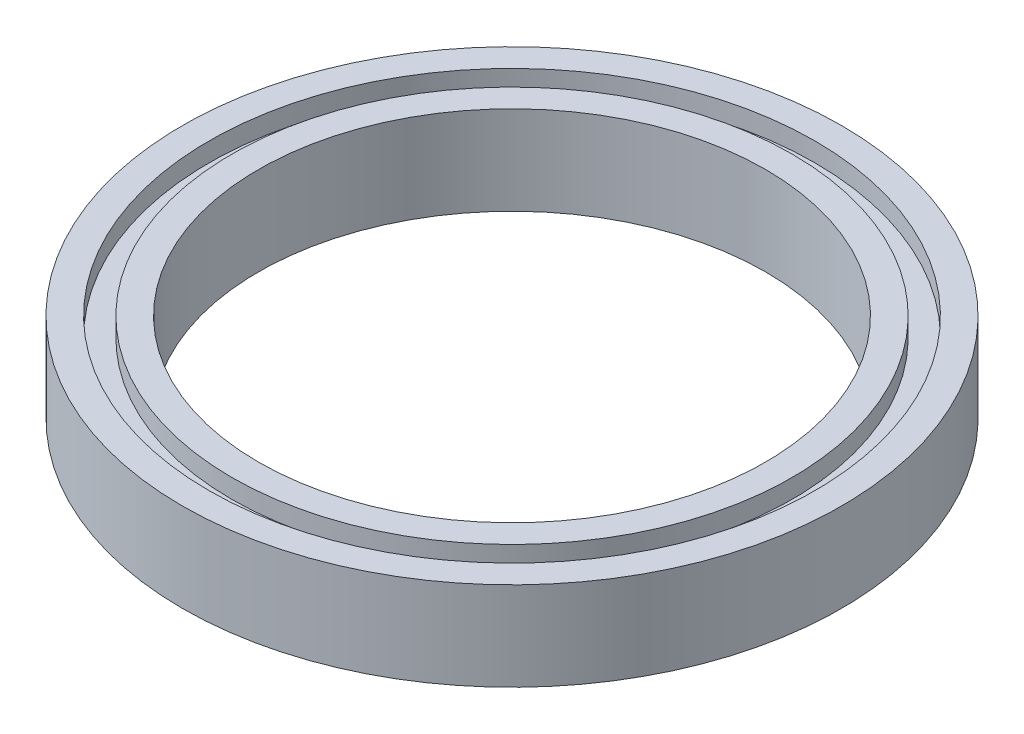
ISO-10303-21;
HEADER;
FILE_DESCRIPTION(('STEP AP214'),'2;1');
FILE_NAME('part.step','',(''),(''),'','','');
FILE_SCHEMA(('AUTOMOTIVE_DESIGN { 1 0 10303 214 1 1 1 1 }'));
ENDSEC;
DATA;
#1=APPLICATION_CONTEXT('core data for automotive mechanical design processes');
#2=APPLICATION_PROTOCOL_DEFINITION('international standard','automotive_design',2000,#1);
#3=PRODUCT_CONTEXT('',#1,'mechanical');
#4=PRODUCT('Part','Part','',(#3));
#5=PRODUCT_RELATED_PRODUCT_CATEGORY('part','',(#4));
#6=PRODUCT_DEFINITION_FORMATION('','',#4);
#7=PRODUCT_DEFINITION_CONTEXT('part definition',#1,'design');
#8=PRODUCT_DEFINITION('design','',#6,#7);
#9=PRODUCT_DEFINITION_SHAPE('','',#8);
#10=(LENGTH_UNIT() NAMED_UNIT(*) SI_UNIT(.MILLI.,.METRE.));
#11=(NAMED_UNIT(*) PLANE_ANGLE_UNIT() SI_UNIT($,.RADIAN.));
#12=(NAMED_UNIT(*) SI_UNIT($,.STERADIAN.) SOLID_ANGLE_UNIT());
#13=UNCERTAINTY_MEASURE_WITH_UNIT(LENGTH_MEASURE(1.E-05),#10,'distance_accuracy_value','');
#14=(GEOMETRIC_REPRESENTATION_CONTEXT(3) GLOBAL_UNCERTAINTY_ASSIGNED_CONTEXT((#13)) GLOBAL_UNIT_ASSIGNED_CONTEXT((#10,
#11,#12)) REPRESENTATION_CONTEXT('',''));
#15=CARTESIAN_POINT('',(0.,0.,0.));
#16=DIRECTION('',(0.,0.,1.));
#17=DIRECTION('',(1.,0.,0.));
#18=AXIS2_PLACEMENT_3D('',#15,#16,#17);
#19=CARTESIAN_POINT('',(0.,0.,0.));
#20=DIRECTION('',(0.,1.,0.));
#21=DIRECTION('',(0.,0.,1.));
#22=AXIS2_PLACEMENT_3D('',#19,#20,#21);
#23=PLANE('',#22);
#24=CARTESIAN_POINT('',(0.,0.,0.));
#25=DIRECTION('',(0.,1.,0.));
#26=DIRECTION('',(0.,0.,1.));
#27=AXIS2_PLACEMENT_3D('',#24,#25,#26);
#28=CIRCLE('',#27,20.);
#29=CARTESIAN_POINT('',(0.,0.,20.));
#30=VERTEX_POINT('',#29);
#31=EDGE_CURVE('E50',#30,#30,#28,.T.);
#32=ORIENTED_EDGE('',*,*,#31,.T.);
#33=EDGE_LOOP('',(#32));
#34=FACE_BOUND('',#33,.T.);
#35=CARTESIAN_POINT('',(0.,0.,0.));
#36=DIRECTION('',(0.,1.,0.));
#37=DIRECTION('',(0.,0.,1.));
#38=AXIS2_PLACEMENT_3D('',#35,#36,#37);
#39=CIRCLE('',#38,22.1);
#40=CARTESIAN_POINT('',(0.,0.,22.1));
#41=VERTEX_POINT('',#40);
#42=EDGE_CURVE('E74',#41,#41,#39,.T.);
#43=ORIENTED_EDGE('',*,*,#42,.F.);
#44=EDGE_LOOP('',(#43));
#45=FACE_BOUND('',#44,.T.);
#46=ADVANCED_FACE('F37',(#34,#45),#23,.F.);
#47=CARTESIAN_POINT('',(0.,7.,0.));
#48=DIRECTION('',(0.,1.,0.));
#49=DIRECTION('',(0.,0.,1.));
#50=AXIS2_PLACEMENT_3D('',#47,#48,#49);
#51=PLANE('',#50);
#52=CARTESIAN_POINT('',(0.,7.,0.));
#53=DIRECTION('',(0.,1.,0.));
#54=DIRECTION('',(0.,0.,1.));
#55=AXIS2_PLACEMENT_3D('',#52,#53,#54);
#56=CIRCLE('',#55,20.);
#57=CARTESIAN_POINT('',(0.,7.,20.));
#58=VERTEX_POINT('',#57);
#59=EDGE_CURVE('E48',#58,#58,#56,.T.);
#60=ORIENTED_EDGE('',*,*,#59,.F.);
#61=EDGE_LOOP('',(#60));
#62=FACE_BOUND('',#61,.T.);
#63=CARTESIAN_POINT('',(0.,7.,0.));
#64=DIRECTION('',(0.,1.,0.));
#65=DIRECTION('',(0.,0.,1.));
#66=AXIS2_PLACEMENT_3D('',#63,#64,#65);
#67=CIRCLE('',#66,22.1);
#68=CARTESIAN_POINT('',(0.,7.,22.1));
#69=VERTEX_POINT('',#68);
#70=EDGE_CURVE('E62',#69,#69,#67,.T.);
#71=ORIENTED_EDGE('',*,*,#70,.T.);
#72=EDGE_LOOP('',(#71));
#73=FACE_BOUND('',#72,.T.);
#74=ADVANCED_FACE('F90',(#62,#73),#51,.T.);
#75=CARTESIAN_POINT('',(0.,7.,0.));
#76=DIRECTION('',(0.,1.,0.));
#77=DIRECTION('',(0.,0.,1.));
#78=AXIS2_PLACEMENT_3D('',#75,#76,#77);
#79=CIRCLE('',#78,23.9);
#80=CARTESIAN_POINT('',(0.,7.,23.9));
#81=VERTEX_POINT('',#80);
#82=EDGE_CURVE('E56',#81,#81,#79,.T.);
#83=ORIENTED_EDGE('',*,*,#82,.F.);
#84=EDGE_LOOP('',(#83));
#85=FACE_BOUND('',#84,.T.);
#86=CARTESIAN_POINT('',(0.,7.,0.));
#87=DIRECTION('',(0.,1.,0.));
#88=DIRECTION('',(0.,0.,1.));
#89=AXIS2_PLACEMENT_3D('',#86,#87,#88);
#90=CIRCLE('',#89,26.);
#91=CARTESIAN_POINT('',(0.,7.,26.));
#92=VERTEX_POINT('',#91);
#93=EDGE_CURVE('E10',#92,#92,#90,.T.);
#94=ORIENTED_EDGE('',*,*,#93,.T.);
#95=EDGE_LOOP('',(#94));
#96=FACE_BOUND('',#95,.T.);
#97=ADVANCED_FACE('F96',(#85,#96),#51,.T.);
#98=CARTESIAN_POINT('',(0.,0.,0.));
#99=DIRECTION('',(0.,1.,0.));
#100=DIRECTION('',(0.,0.,1.));
#101=AXIS2_PLACEMENT_3D('',#98,#99,#100);
#102=CIRCLE('',#101,23.9);
#103=CARTESIAN_POINT('',(0.,0.,23.9));
#104=VERTEX_POINT('',#103);
#105=EDGE_CURVE('E68',#104,#104,#102,.T.);
#106=ORIENTED_EDGE('',*,*,#105,.T.);
#107=EDGE_LOOP('',(#106));
#108=FACE_BOUND('',#107,.T.);
#109=CARTESIAN_POINT('',(0.,0.,0.));
#110=DIRECTION('',(0.,1.,0.));
#111=DIRECTION('',(0.,0.,1.));
#112=AXIS2_PLACEMENT_3D('',#109,#110,#111);
#113=CIRCLE('',#112,26.);
#114=CARTESIAN_POINT('',(0.,0.,26.));
#115=VERTEX_POINT('',#114);
#116=EDGE_CURVE('E41',#115,#115,#113,.T.);
#117=ORIENTED_EDGE('',*,*,#116,.F.);
#118=EDGE_LOOP('',(#117));
#119=FACE_BOUND('',#118,.T.);
#120=ADVANCED_FACE('F92',(#108,#119),#23,.F.);
#121=CARTESIAN_POINT('',(0.,7.,0.));
#122=DIRECTION('',(0.,-1.,0.));
#123=DIRECTION('',(0.,0.,-1.));
#124=AXIS2_PLACEMENT_3D('',#121,#122,#123);
#125=CYLINDRICAL_SURFACE('',#124,26.);
#126=ORIENTED_EDGE('',*,*,#93,.F.);
#127=EDGE_LOOP('',(#126));
#128=FACE_BOUND('',#127,.T.);
#129=ORIENTED_EDGE('',*,*,#116,.T.);
#130=EDGE_LOOP('',(#129));
#131=FACE_BOUND('',#130,.T.);
#132=ADVANCED_FACE('F39',(#128,#131),#125,.T.);
#133=CARTESIAN_POINT('',(0.,7.,0.));
#134=DIRECTION('',(0.,-1.,0.));
#135=DIRECTION('',(0.,0.,-1.));
#136=AXIS2_PLACEMENT_3D('',#133,#134,#135);
#137=CYLINDRICAL_SURFACE('',#136,20.);
#138=ORIENTED_EDGE('',*,*,#59,.T.);
#139=EDGE_LOOP('',(#138));
#140=FACE_BOUND('',#139,.T.);
#141=ORIENTED_EDGE('',*,*,#31,.F.);
#142=EDGE_LOOP('',(#141));
#143=FACE_BOUND('',#142,.T.);
#144=ADVANCED_FACE('F105',(#140,#143),#137,.F.);
#145=CARTESIAN_POINT('',(0.,5.5,0.));
#146=DIRECTION('',(0.,1.,0.));
#147=DIRECTION('',(0.,0.,1.));
#148=AXIS2_PLACEMENT_3D('',#145,#146,#147);
#149=CYLINDRICAL_SURFACE('',#148,23.9);
#150=CARTESIAN_POINT('',(0.,5.5,0.));
#151=DIRECTION('',(0.,1.,0.));
#152=DIRECTION('',(0.,0.,1.));
#153=AXIS2_PLACEMENT_3D('',#150,#151,#152);
#154=CIRCLE('',#153,23.9);
#155=CARTESIAN_POINT('',(0.,5.5,23.9));
#156=VERTEX_POINT('',#155);
#157=EDGE_CURVE('E53',#156,#156,#154,.T.);
#158=ORIENTED_EDGE('',*,*,#157,.F.);
#159=EDGE_LOOP('',(#158));
#160=FACE_BOUND('',#159,.T.);
#161=ORIENTED_EDGE('',*,*,#82,.T.);
#162=EDGE_LOOP('',(#161));
#163=FACE_BOUND('',#162,.T.);
#164=ADVANCED_FACE('F129',(#160,#163),#149,.F.);
#165=CARTESIAN_POINT('',(0.,5.5,0.));
#166=DIRECTION('',(0.,1.,0.));
#167=DIRECTION('',(0.,0.,1.));
#168=AXIS2_PLACEMENT_3D('',#165,#166,#167);
#169=PLANE('',#168);
#170=CARTESIAN_POINT('',(0.,5.5,0.));
#171=DIRECTION('',(0.,1.,0.));
#172=DIRECTION('',(0.,0.,1.));
#173=AXIS2_PLACEMENT_3D('',#170,#171,#172);
#174=CIRCLE('',#173,22.1);
#175=CARTESIAN_POINT('',(0.,5.5,22.1));
#176=VERTEX_POINT('',#175);
#177=EDGE_CURVE('E59',#176,#176,#174,.T.);
#178=ORIENTED_EDGE('',*,*,#177,.F.);
#179=EDGE_LOOP('',(#178));
#180=FACE_BOUND('',#179,.T.);
#181=ORIENTED_EDGE('',*,*,#157,.T.);
#182=EDGE_LOOP('',(#181));
#183=FACE_BOUND('',#182,.T.);
#184=ADVANCED_FACE('F125',(#180,#183),#169,.T.);
#185=CARTESIAN_POINT('',(0.,5.5,0.));
#186=DIRECTION('',(0.,1.,0.));
#187=DIRECTION('',(0.,0.,1.));
#188=AXIS2_PLACEMENT_3D('',#185,#186,#187);
#189=CYLINDRICAL_SURFACE('',#188,22.1);
#190=ORIENTED_EDGE('',*,*,#177,.T.);
#191=EDGE_LOOP('',(#190));
#192=FACE_BOUND('',#191,.T.);
#193=ORIENTED_EDGE('',*,*,#70,.F.);
#194=EDGE_LOOP('',(#193));
#195=FACE_BOUND('',#194,.T.);
#196=ADVANCED_FACE('F119',(#192,#195),#189,.T.);
#197=CARTESIAN_POINT('',(0.,1.5,0.));
#198=DIRECTION('',(0.,-1.,0.));
#199=DIRECTION('',(0.,0.,1.));
#200=AXIS2_PLACEMENT_3D('',#197,#198,#199);
#201=PLANE('',#200);
#202=CARTESIAN_POINT('',(0.,1.5,0.));
#203=DIRECTION('',(0.,1.,0.));
#204=DIRECTION('',(0.,0.,1.));
#205=AXIS2_PLACEMENT_3D('',#202,#203,#204);
#206=CIRCLE('',#205,23.9);
#207=CARTESIAN_POINT('',(0.,1.5,23.9));
#208=VERTEX_POINT('',#207);
#209=EDGE_CURVE('E65',#208,#208,#206,.T.);
#210=ORIENTED_EDGE('',*,*,#209,.F.);
#211=EDGE_LOOP('',(#210));
#212=FACE_BOUND('',#211,.T.);
#213=CARTESIAN_POINT('',(0.,1.5,0.));
#214=DIRECTION('',(0.,1.,0.));
#215=DIRECTION('',(0.,0.,1.));
#216=AXIS2_PLACEMENT_3D('',#213,#214,#215);
#217=CIRCLE('',#216,22.1);
#218=CARTESIAN_POINT('',(0.,1.5,22.1));
#219=VERTEX_POINT('',#218);
#220=EDGE_CURVE('E71',#219,#219,#217,.T.);
#221=ORIENTED_EDGE('',*,*,#220,.T.);
#222=EDGE_LOOP('',(#221));
#223=FACE_BOUND('',#222,.T.);
#224=ADVANCED_FACE('F80',(#212,#223),#201,.T.);
#225=CARTESIAN_POINT('',(0.,1.5,0.));
#226=DIRECTION('',(0.,-1.,0.));
#227=DIRECTION('',(0.,0.,-1.));
#228=AXIS2_PLACEMENT_3D('',#225,#226,#227);
#229=CYLINDRICAL_SURFACE('',#228,23.9);
#230=ORIENTED_EDGE('',*,*,#209,.T.);
#231=EDGE_LOOP('',(#230));
#232=FACE_BOUND('',#231,.T.);
#233=ORIENTED_EDGE('',*,*,#105,.F.);
#234=EDGE_LOOP('',(#233));
#235=FACE_BOUND('',#234,.T.);
#236=ADVANCED_FACE('F85',(#232,#235),#229,.F.);
#237=CARTESIAN_POINT('',(0.,1.5,0.));
#238=DIRECTION('',(0.,-1.,0.));
#239=DIRECTION('',(0.,0.,-1.));
#240=AXIS2_PLACEMENT_3D('',#237,#238,#239);
#241=CYLINDRICAL_SURFACE('',#240,22.1);
#242=ORIENTED_EDGE('',*,*,#220,.F.);
#243=EDGE_LOOP('',(#242));
#244=FACE_BOUND('',#243,.T.);
#245=ORIENTED_EDGE('',*,*,#42,.T.);
#246=EDGE_LOOP('',(#245));
#247=FACE_BOUND('',#246,.T.);
#248=ADVANCED_FACE('F82',(#244,#247),#241,.T.);
#249=CLOSED_SHELL('',(#46,#74,#97,#120,#132,#144,#164,#184,#196,#224,#236,#248));
#250=MANIFOLD_SOLID_BREP('B2',#249);
#251=ADVANCED_BREP_SHAPE_REPRESENTATION('',(#18,#250),#14);
#252=SHAPE_DEFINITION_REPRESENTATION(#9,#251);
ENDSEC;
END-ISO-10303-21;
